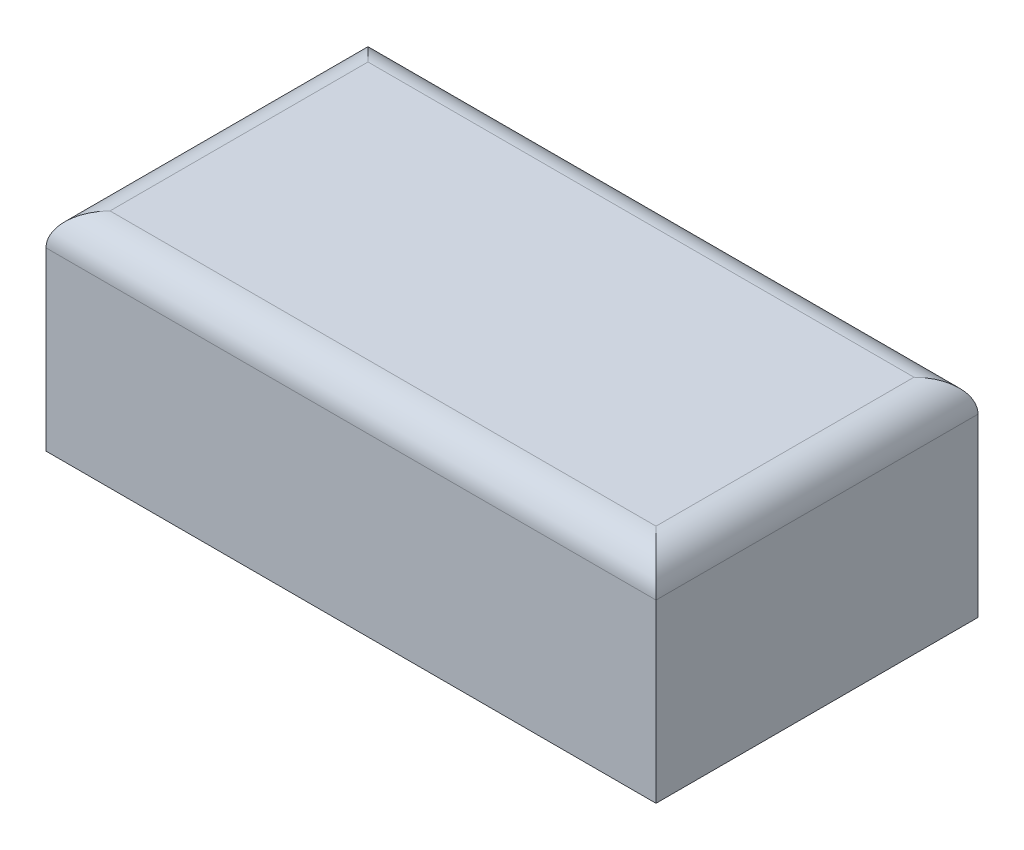
ISO-10303-21;
HEADER;
FILE_DESCRIPTION(('STEP AP214'),'2;1');
FILE_NAME('part.step','',(''),(''),'','','');
FILE_SCHEMA(('AUTOMOTIVE_DESIGN { 1 0 10303 214 1 1 1 1 }'));
ENDSEC;
DATA;
#1=APPLICATION_CONTEXT('core data for automotive mechanical design processes');
#2=APPLICATION_PROTOCOL_DEFINITION('international standard','automotive_design',2000,#1);
#3=PRODUCT_CONTEXT('',#1,'mechanical');
#4=PRODUCT('Part','Part','',(#3));
#5=PRODUCT_RELATED_PRODUCT_CATEGORY('part','',(#4));
#6=PRODUCT_DEFINITION_FORMATION('','',#4);
#7=PRODUCT_DEFINITION_CONTEXT('part definition',#1,'design');
#8=PRODUCT_DEFINITION('design','',#6,#7);
#9=PRODUCT_DEFINITION_SHAPE('','',#8);
#10=(LENGTH_UNIT() NAMED_UNIT(*) SI_UNIT(.MILLI.,.METRE.));
#11=(NAMED_UNIT(*) PLANE_ANGLE_UNIT() SI_UNIT($,.RADIAN.));
#12=(NAMED_UNIT(*) SI_UNIT($,.STERADIAN.) SOLID_ANGLE_UNIT());
#13=UNCERTAINTY_MEASURE_WITH_UNIT(LENGTH_MEASURE(1.E-05),#10,'distance_accuracy_value','');
#14=(GEOMETRIC_REPRESENTATION_CONTEXT(3) GLOBAL_UNCERTAINTY_ASSIGNED_CONTEXT((#13)) GLOBAL_UNIT_ASSIGNED_CONTEXT((#10,
#11,#12)) REPRESENTATION_CONTEXT('',''));
#15=CARTESIAN_POINT('',(0.,0.,0.));
#16=DIRECTION('',(0.,0.,1.));
#17=DIRECTION('',(1.,0.,0.));
#18=AXIS2_PLACEMENT_3D('',#15,#16,#17);
#19=CARTESIAN_POINT('',(-953.,652.,-503.));
#20=DIRECTION('',(1.,0.,0.));
#21=DIRECTION('',(0.,0.,-1.));
#22=AXIS2_PLACEMENT_3D('',#19,#20,#21);
#23=PLANE('',#22);
#24=DIRECTION('',(0.,-1.,0.));
#25=VECTOR('',#24,1.);
#26=CARTESIAN_POINT('',(-953.,652.,503.));
#27=LINE('',#26,#25);
#28=CARTESIAN_POINT('',(-953.,552.,503.));
#29=VERTEX_POINT('',#28);
#30=CARTESIAN_POINT('',(-953.,2.,503.));
#31=VERTEX_POINT('',#30);
#32=EDGE_CURVE('E226',#29,#31,#27,.T.);
#33=ORIENTED_EDGE('',*,*,#32,.F.);
#34=DIRECTION('',(0.,0.,1.));
#35=VECTOR('',#34,1.);
#36=CARTESIAN_POINT('',(-953.,552.,-503.));
#37=LINE('',#36,#35);
#38=CARTESIAN_POINT('',(-953.,552.,-503.));
#39=VERTEX_POINT('',#38);
#40=EDGE_CURVE('E256',#29,#39,#37,.F.);
#41=ORIENTED_EDGE('',*,*,#40,.T.);
#42=DIRECTION('',(0.,-1.,0.));
#43=VECTOR('',#42,1.);
#44=CARTESIAN_POINT('',(-953.,652.,-503.));
#45=LINE('',#44,#43);
#46=CARTESIAN_POINT('',(-953.,2.,-503.));
#47=VERTEX_POINT('',#46);
#48=EDGE_CURVE('E219',#39,#47,#45,.T.);
#49=ORIENTED_EDGE('',*,*,#48,.T.);
#50=DIRECTION('',(0.,0.,-1.));
#51=VECTOR('',#50,1.);
#52=CARTESIAN_POINT('',(-953.,2.,503.));
#53=LINE('',#52,#51);
#54=EDGE_CURVE('E207',#31,#47,#53,.T.);
#55=ORIENTED_EDGE('',*,*,#54,.F.);
#56=EDGE_LOOP('',(#33,#41,#49,#55));
#57=FACE_BOUND('',#56,.T.);
#58=ADVANCED_FACE('F41',(#57),#23,.F.);
#59=CARTESIAN_POINT('',(953.,652.,503.));
#60=DIRECTION('',(0.,0.,-1.));
#61=DIRECTION('',(-1.,0.,0.));
#62=AXIS2_PLACEMENT_3D('',#59,#60,#61);
#63=PLANE('',#62);
#64=DIRECTION('',(0.,-1.,0.));
#65=VECTOR('',#64,1.);
#66=CARTESIAN_POINT('',(953.,652.,503.));
#67=LINE('',#66,#65);
#68=CARTESIAN_POINT('',(953.,552.,503.));
#69=VERTEX_POINT('',#68);
#70=CARTESIAN_POINT('',(953.,2.,503.));
#71=VERTEX_POINT('',#70);
#72=EDGE_CURVE('E224',#69,#71,#67,.T.);
#73=ORIENTED_EDGE('',*,*,#72,.F.);
#74=DIRECTION('',(1.,0.,0.));
#75=VECTOR('',#74,1.);
#76=CARTESIAN_POINT('',(953.,552.,503.));
#77=LINE('',#76,#75);
#78=EDGE_CURVE('E258',#69,#29,#77,.F.);
#79=ORIENTED_EDGE('',*,*,#78,.T.);
#80=ORIENTED_EDGE('',*,*,#32,.T.);
#81=DIRECTION('',(-1.,0.,0.));
#82=VECTOR('',#81,1.);
#83=CARTESIAN_POINT('',(953.,2.,503.));
#84=LINE('',#83,#82);
#85=EDGE_CURVE('E216',#71,#31,#84,.T.);
#86=ORIENTED_EDGE('',*,*,#85,.F.);
#87=EDGE_LOOP('',(#73,#79,#80,#86));
#88=FACE_BOUND('',#87,.T.);
#89=ADVANCED_FACE('F334',(#88),#63,.F.);
#90=CARTESIAN_POINT('',(953.,652.,-503.));
#91=DIRECTION('',(-1.,0.,0.));
#92=DIRECTION('',(0.,0.,1.));
#93=AXIS2_PLACEMENT_3D('',#90,#91,#92);
#94=PLANE('',#93);
#95=DIRECTION('',(0.,-1.,0.));
#96=VECTOR('',#95,1.);
#97=CARTESIAN_POINT('',(953.,652.,-503.));
#98=LINE('',#97,#96);
#99=CARTESIAN_POINT('',(953.,552.,-503.));
#100=VERTEX_POINT('',#99);
#101=CARTESIAN_POINT('',(953.,2.,-503.));
#102=VERTEX_POINT('',#101);
#103=EDGE_CURVE('E221',#100,#102,#98,.T.);
#104=ORIENTED_EDGE('',*,*,#103,.F.);
#105=DIRECTION('',(0.,0.,-1.));
#106=VECTOR('',#105,1.);
#107=CARTESIAN_POINT('',(953.,552.,-503.));
#108=LINE('',#107,#106);
#109=EDGE_CURVE('E64',#100,#69,#108,.F.);
#110=ORIENTED_EDGE('',*,*,#109,.T.);
#111=ORIENTED_EDGE('',*,*,#72,.T.);
#112=DIRECTION('',(0.,0.,1.));
#113=VECTOR('',#112,1.);
#114=CARTESIAN_POINT('',(953.,2.,503.));
#115=LINE('',#114,#113);
#116=EDGE_CURVE('E213',#102,#71,#115,.T.);
#117=ORIENTED_EDGE('',*,*,#116,.F.);
#118=EDGE_LOOP('',(#104,#110,#111,#117));
#119=FACE_BOUND('',#118,.T.);
#120=ADVANCED_FACE('F340',(#119),#94,.F.);
#121=CARTESIAN_POINT('',(953.,652.,-503.));
#122=DIRECTION('',(0.,0.,1.));
#123=DIRECTION('',(1.,0.,0.));
#124=AXIS2_PLACEMENT_3D('',#121,#122,#123);
#125=PLANE('',#124);
#126=DIRECTION('',(1.,0.,0.));
#127=VECTOR('',#126,1.);
#128=CARTESIAN_POINT('',(953.,2.,-503.));
#129=LINE('',#128,#127);
#130=CARTESIAN_POINT('',(700.,2.,-503.));
#131=VERTEX_POINT('',#130);
#132=EDGE_CURVE('E210',#131,#102,#129,.T.);
#133=ORIENTED_EDGE('',*,*,#132,.F.);
#134=DIRECTION('',(0.,-1.,0.));
#135=VECTOR('',#134,1.);
#136=CARTESIAN_POINT('',(700.,282.,-503.));
#137=LINE('',#136,#135);
#138=CARTESIAN_POINT('',(700.,282.,-503.));
#139=VERTEX_POINT('',#138);
#140=EDGE_CURVE('E170',#139,#131,#137,.T.);
#141=ORIENTED_EDGE('',*,*,#140,.F.);
#142=DIRECTION('',(1.,0.,0.));
#143=VECTOR('',#142,1.);
#144=CARTESIAN_POINT('',(-700.,282.,-503.));
#145=LINE('',#144,#143);
#146=CARTESIAN_POINT('',(-700.,282.,-503.));
#147=VERTEX_POINT('',#146);
#148=EDGE_CURVE('E156',#147,#139,#145,.T.);
#149=ORIENTED_EDGE('',*,*,#148,.F.);
#150=DIRECTION('',(0.,1.,0.));
#151=VECTOR('',#150,1.);
#152=CARTESIAN_POINT('',(-700.,282.,-503.));
#153=LINE('',#152,#151);
#154=CARTESIAN_POINT('',(-700.,2.,-503.));
#155=VERTEX_POINT('',#154);
#156=EDGE_CURVE('E163',#155,#147,#153,.T.);
#157=ORIENTED_EDGE('',*,*,#156,.F.);
#158=EDGE_CURVE('E211',#47,#155,#129,.T.);
#159=ORIENTED_EDGE('',*,*,#158,.F.);
#160=ORIENTED_EDGE('',*,*,#48,.F.);
#161=DIRECTION('',(-1.,0.,0.));
#162=VECTOR('',#161,1.);
#163=CARTESIAN_POINT('',(953.,552.,-503.));
#164=LINE('',#163,#162);
#165=EDGE_CURVE('E253',#39,#100,#164,.F.);
#166=ORIENTED_EDGE('',*,*,#165,.T.);
#167=ORIENTED_EDGE('',*,*,#103,.T.);
#168=EDGE_LOOP('',(#133,#141,#149,#157,#159,#160,#166,#167));
#169=FACE_BOUND('',#168,.T.);
#170=ADVANCED_FACE('F173',(#169),#125,.F.);
#171=CARTESIAN_POINT('',(0.,652.,0.));
#172=DIRECTION('',(0.,-1.,0.));
#173=DIRECTION('',(0.,0.,-1.));
#174=AXIS2_PLACEMENT_3D('',#171,#172,#173);
#175=PLANE('',#174);
#176=DIRECTION('',(0.,0.,-1.));
#177=VECTOR('',#176,1.);
#178=CARTESIAN_POINT('',(853.,652.,0.));
#179=LINE('',#178,#177);
#180=CARTESIAN_POINT('',(853.,652.,403.));
#181=VERTEX_POINT('',#180);
#182=CARTESIAN_POINT('',(853.,652.,-403.));
#183=VERTEX_POINT('',#182);
#184=EDGE_CURVE('E244',#181,#183,#179,.T.);
#185=ORIENTED_EDGE('',*,*,#184,.T.);
#186=DIRECTION('',(-1.,0.,0.));
#187=VECTOR('',#186,1.);
#188=CARTESIAN_POINT('',(0.,652.,-403.));
#189=LINE('',#188,#187);
#190=CARTESIAN_POINT('',(-853.,652.,-403.));
#191=VERTEX_POINT('',#190);
#192=EDGE_CURVE('E250',#183,#191,#189,.T.);
#193=ORIENTED_EDGE('',*,*,#192,.T.);
#194=DIRECTION('',(0.,0.,1.));
#195=VECTOR('',#194,1.);
#196=CARTESIAN_POINT('',(-853.,652.,1.88274401591503E-13));
#197=LINE('',#196,#195);
#198=CARTESIAN_POINT('',(-853.,652.,403.));
#199=VERTEX_POINT('',#198);
#200=EDGE_CURVE('E248',#191,#199,#197,.T.);
#201=ORIENTED_EDGE('',*,*,#200,.T.);
#202=DIRECTION('',(1.,0.,0.));
#203=VECTOR('',#202,1.);
#204=CARTESIAN_POINT('',(0.,652.,403.));
#205=LINE('',#204,#203);
#206=EDGE_CURVE('E246',#199,#181,#205,.T.);
#207=ORIENTED_EDGE('',*,*,#206,.T.);
#208=EDGE_LOOP('',(#185,#193,#201,#207));
#209=FACE_BOUND('',#208,.T.);
#210=ADVANCED_FACE('F382',(#209),#175,.F.);
#211=CARTESIAN_POINT('',(0.,2.,0.));
#212=DIRECTION('',(0.,1.,0.));
#213=DIRECTION('',(0.,0.,1.));
#214=AXIS2_PLACEMENT_3D('',#211,#212,#213);
#215=PLANE('',#214);
#216=DIRECTION('',(1.,0.,0.));
#217=VECTOR('',#216,1.);
#218=CARTESIAN_POINT('',(950.,2.,-501.416579223504));
#219=LINE('',#218,#217);
#220=CARTESIAN_POINT('',(700.,2.,-501.416579223504));
#221=VERTEX_POINT('',#220);
#222=CARTESIAN_POINT('',(950.,2.,-501.416579223504));
#223=VERTEX_POINT('',#222);
#224=EDGE_CURVE('E185',#221,#223,#219,.T.);
#225=ORIENTED_EDGE('',*,*,#224,.F.);
#226=DIRECTION('',(0.,0.,-1.));
#227=VECTOR('',#226,1.);
#228=CARTESIAN_POINT('',(700.,2.,-1.02257383847054E-13));
#229=LINE('',#228,#227);
#230=EDGE_CURVE('E179',#221,#131,#229,.T.);
#231=ORIENTED_EDGE('',*,*,#230,.T.);
#232=ORIENTED_EDGE('',*,*,#132,.T.);
#233=ORIENTED_EDGE('',*,*,#116,.T.);
#234=ORIENTED_EDGE('',*,*,#85,.T.);
#235=ORIENTED_EDGE('',*,*,#54,.T.);
#236=ORIENTED_EDGE('',*,*,#158,.T.);
#237=DIRECTION('',(0.,0.,1.));
#238=VECTOR('',#237,1.);
#239=CARTESIAN_POINT('',(-700.,2.,1.02257383847054E-13));
#240=LINE('',#239,#238);
#241=CARTESIAN_POINT('',(-700.,2.,-501.416579223505));
#242=VERTEX_POINT('',#241);
#243=EDGE_CURVE('E166',#155,#242,#240,.T.);
#244=ORIENTED_EDGE('',*,*,#243,.T.);
#245=CARTESIAN_POINT('',(-950.,2.,-501.416579223505));
#246=VERTEX_POINT('',#245);
#247=EDGE_CURVE('E187',#246,#242,#219,.T.);
#248=ORIENTED_EDGE('',*,*,#247,.F.);
#249=DIRECTION('',(0.,0.,-1.));
#250=VECTOR('',#249,1.);
#251=CARTESIAN_POINT('',(-950.,2.,501.416579223504));
#252=LINE('',#251,#250);
#253=CARTESIAN_POINT('',(-950.,2.,501.416579223504));
#254=VERTEX_POINT('',#253);
#255=EDGE_CURVE('E183',#254,#246,#252,.T.);
#256=ORIENTED_EDGE('',*,*,#255,.F.);
#257=DIRECTION('',(-1.,0.,0.));
#258=VECTOR('',#257,1.);
#259=CARTESIAN_POINT('',(949.999999999999,2.,501.416579223504));
#260=LINE('',#259,#258);
#261=CARTESIAN_POINT('',(949.999999999999,2.,501.416579223504));
#262=VERTEX_POINT('',#261);
#263=EDGE_CURVE('E193',#262,#254,#260,.T.);
#264=ORIENTED_EDGE('',*,*,#263,.F.);
#265=DIRECTION('',(0.,0.,1.));
#266=VECTOR('',#265,1.);
#267=CARTESIAN_POINT('',(949.999999999999,2.,501.416579223504));
#268=LINE('',#267,#266);
#269=EDGE_CURVE('E190',#223,#262,#268,.T.);
#270=ORIENTED_EDGE('',*,*,#269,.F.);
#271=EDGE_LOOP('',(#225,#231,#232,#233,#234,#235,#236,#244,#248,#256,#264,#270));
#272=FACE_BOUND('',#271,.T.);
#273=ADVANCED_FACE('F286',(#272),#215,.F.);
#274=CARTESIAN_POINT('',(-950.,2.,501.416579223504));
#275=DIRECTION('',(1.,0.,0.));
#276=DIRECTION('',(0.,0.,-1.));
#277=AXIS2_PLACEMENT_3D('',#274,#275,#276);
#278=PLANE('',#277);
#279=DIRECTION('',(0.,1.,0.));
#280=VECTOR('',#279,1.);
#281=CARTESIAN_POINT('',(-950.,2.,-501.416579223505));
#282=LINE('',#281,#280);
#283=CARTESIAN_POINT('',(-950.,550.,-501.416579223505));
#284=VERTEX_POINT('',#283);
#285=EDGE_CURVE('E204',#246,#284,#282,.T.);
#286=ORIENTED_EDGE('',*,*,#285,.T.);
#287=DIRECTION('',(0.,0.,-1.));
#288=VECTOR('',#287,1.);
#289=CARTESIAN_POINT('',(-950.,550.,501.416579223504));
#290=LINE('',#289,#288);
#291=CARTESIAN_POINT('',(-950.,550.,501.416579223504));
#292=VERTEX_POINT('',#291);
#293=EDGE_CURVE('E242',#284,#292,#290,.F.);
#294=ORIENTED_EDGE('',*,*,#293,.T.);
#295=DIRECTION('',(0.,1.,0.));
#296=VECTOR('',#295,1.);
#297=CARTESIAN_POINT('',(-950.,2.,501.416579223504));
#298=LINE('',#297,#296);
#299=EDGE_CURVE('E195',#254,#292,#298,.T.);
#300=ORIENTED_EDGE('',*,*,#299,.F.);
#301=ORIENTED_EDGE('',*,*,#255,.T.);
#302=EDGE_LOOP('',(#286,#294,#300,#301));
#303=FACE_BOUND('',#302,.T.);
#304=ADVANCED_FACE('F294',(#303),#278,.T.);
#305=CARTESIAN_POINT('',(950.,2.,-501.416579223504));
#306=DIRECTION('',(0.,0.,1.));
#307=DIRECTION('',(1.,0.,0.));
#308=AXIS2_PLACEMENT_3D('',#305,#306,#307);
#309=PLANE('',#308);
#310=DIRECTION('',(0.,1.,0.));
#311=VECTOR('',#310,1.);
#312=CARTESIAN_POINT('',(700.,2.00000000000005,-501.416579223504));
#313=LINE('',#312,#311);
#314=CARTESIAN_POINT('',(700.,282.,-501.416579223505));
#315=VERTEX_POINT('',#314);
#316=EDGE_CURVE('E11',#221,#315,#313,.T.);
#317=ORIENTED_EDGE('',*,*,#316,.F.);
#318=ORIENTED_EDGE('',*,*,#224,.T.);
#319=DIRECTION('',(0.,1.,0.));
#320=VECTOR('',#319,1.);
#321=CARTESIAN_POINT('',(950.,2.,-501.416579223504));
#322=LINE('',#321,#320);
#323=CARTESIAN_POINT('',(950.,550.,-501.416579223504));
#324=VERTEX_POINT('',#323);
#325=EDGE_CURVE('E201',#223,#324,#322,.T.);
#326=ORIENTED_EDGE('',*,*,#325,.T.);
#327=DIRECTION('',(1.,0.,0.));
#328=VECTOR('',#327,1.);
#329=CARTESIAN_POINT('',(-950.,550.,-501.416579223505));
#330=LINE('',#329,#328);
#331=EDGE_CURVE('E240',#324,#284,#330,.F.);
#332=ORIENTED_EDGE('',*,*,#331,.T.);
#333=ORIENTED_EDGE('',*,*,#285,.F.);
#334=ORIENTED_EDGE('',*,*,#247,.T.);
#335=DIRECTION('',(0.,-1.,0.));
#336=VECTOR('',#335,1.);
#337=CARTESIAN_POINT('',(-700.,2.00000000000033,-501.416579223505));
#338=LINE('',#337,#336);
#339=CARTESIAN_POINT('',(-700.,282.,-501.416579223505));
#340=VERTEX_POINT('',#339);
#341=EDGE_CURVE('E263',#340,#242,#338,.T.);
#342=ORIENTED_EDGE('',*,*,#341,.F.);
#343=DIRECTION('',(-1.,0.,0.));
#344=VECTOR('',#343,1.);
#345=CARTESIAN_POINT('',(950.,282.,-501.416579223504));
#346=LINE('',#345,#344);
#347=EDGE_CURVE('E49',#315,#340,#346,.T.);
#348=ORIENTED_EDGE('',*,*,#347,.F.);
#349=EDGE_LOOP('',(#317,#318,#326,#332,#333,#334,#342,#348));
#350=FACE_BOUND('',#349,.T.);
#351=ADVANCED_FACE('F290',(#350),#309,.T.);
#352=CARTESIAN_POINT('',(949.999999999999,2.,501.416579223504));
#353=DIRECTION('',(-1.,0.,0.));
#354=DIRECTION('',(0.,0.,1.));
#355=AXIS2_PLACEMENT_3D('',#352,#353,#354);
#356=PLANE('',#355);
#357=DIRECTION('',(0.,1.,0.));
#358=VECTOR('',#357,1.);
#359=CARTESIAN_POINT('',(949.999999999999,2.,501.416579223504));
#360=LINE('',#359,#358);
#361=CARTESIAN_POINT('',(949.999999999999,550.,501.416579223504));
#362=VERTEX_POINT('',#361);
#363=EDGE_CURVE('E198',#262,#362,#360,.T.);
#364=ORIENTED_EDGE('',*,*,#363,.T.);
#365=DIRECTION('',(0.,0.,1.));
#366=VECTOR('',#365,1.);
#367=CARTESIAN_POINT('',(950.,550.,-501.416579223504));
#368=LINE('',#367,#366);
#369=EDGE_CURVE('E260',#362,#324,#368,.F.);
#370=ORIENTED_EDGE('',*,*,#369,.T.);
#371=ORIENTED_EDGE('',*,*,#325,.F.);
#372=ORIENTED_EDGE('',*,*,#269,.T.);
#373=EDGE_LOOP('',(#364,#370,#371,#372));
#374=FACE_BOUND('',#373,.T.);
#375=ADVANCED_FACE('F314',(#374),#356,.T.);
#376=CARTESIAN_POINT('',(949.999999999999,2.,501.416579223504));
#377=DIRECTION('',(0.,0.,-1.));
#378=DIRECTION('',(-1.,0.,0.));
#379=AXIS2_PLACEMENT_3D('',#376,#377,#378);
#380=PLANE('',#379);
#381=ORIENTED_EDGE('',*,*,#299,.T.);
#382=DIRECTION('',(-1.,0.,0.));
#383=VECTOR('',#382,1.);
#384=CARTESIAN_POINT('',(949.999999999999,550.,501.416579223504));
#385=LINE('',#384,#383);
#386=EDGE_CURVE('E237',#292,#362,#385,.F.);
#387=ORIENTED_EDGE('',*,*,#386,.T.);
#388=ORIENTED_EDGE('',*,*,#363,.F.);
#389=ORIENTED_EDGE('',*,*,#263,.T.);
#390=EDGE_LOOP('',(#381,#387,#388,#389));
#391=FACE_BOUND('',#390,.T.);
#392=ADVANCED_FACE('F312',(#391),#380,.T.);
#393=CARTESIAN_POINT('',(0.,650.,0.));
#394=DIRECTION('',(0.,-1.,0.));
#395=DIRECTION('',(0.,0.,-1.));
#396=AXIS2_PLACEMENT_3D('',#393,#394,#395);
#397=PLANE('',#396);
#398=DIRECTION('',(-1.,0.,0.));
#399=VECTOR('',#398,1.);
#400=CARTESIAN_POINT('',(-950.,650.,401.416579223504));
#401=LINE('',#400,#399);
#402=CARTESIAN_POINT('',(849.999999999999,650.,401.416579223504));
#403=VERTEX_POINT('',#402);
#404=CARTESIAN_POINT('',(-850.000000000001,650.,401.416579223504));
#405=VERTEX_POINT('',#404);
#406=EDGE_CURVE('E232',#403,#405,#401,.T.);
#407=ORIENTED_EDGE('',*,*,#406,.T.);
#408=DIRECTION('',(0.,0.,-1.));
#409=VECTOR('',#408,1.);
#410=CARTESIAN_POINT('',(-850.,650.,-501.416579223505));
#411=LINE('',#410,#409);
#412=CARTESIAN_POINT('',(-850.,650.,-401.416579223505));
#413=VERTEX_POINT('',#412);
#414=EDGE_CURVE('E235',#405,#413,#411,.T.);
#415=ORIENTED_EDGE('',*,*,#414,.T.);
#416=DIRECTION('',(1.,0.,0.));
#417=VECTOR('',#416,1.);
#418=CARTESIAN_POINT('',(950.,650.,-401.416579223504));
#419=LINE('',#418,#417);
#420=CARTESIAN_POINT('',(850.,650.,-401.416579223504));
#421=VERTEX_POINT('',#420);
#422=EDGE_CURVE('E230',#413,#421,#419,.T.);
#423=ORIENTED_EDGE('',*,*,#422,.T.);
#424=DIRECTION('',(0.,0.,1.));
#425=VECTOR('',#424,1.);
#426=CARTESIAN_POINT('',(849.999999999999,650.,501.416579223504));
#427=LINE('',#426,#425);
#428=EDGE_CURVE('E228',#421,#403,#427,.T.);
#429=ORIENTED_EDGE('',*,*,#428,.T.);
#430=EDGE_LOOP('',(#407,#415,#423,#429));
#431=FACE_BOUND('',#430,.T.);
#432=ADVANCED_FACE('F355',(#431),#397,.T.);
#433=CARTESIAN_POINT('',(0.,550.,-401.416579223505));
#434=DIRECTION('',(-1.,0.,0.));
#435=DIRECTION('',(0.,0.,1.));
#436=AXIS2_PLACEMENT_3D('',#433,#434,#435);
#437=CYLINDRICAL_SURFACE('',#436,100.);
#438=CARTESIAN_POINT('',(-850.000000000001,550.,-401.416579223505));
#439=DIRECTION('',(-0.707106781186548,0.,0.707106781186547));
#440=DIRECTION('',(-0.707106781186547,0.,-0.707106781186548));
#441=AXIS2_PLACEMENT_3D('',#438,#439,#440);
#442=ELLIPSE('',#441,141.421356237309,100.);
#443=EDGE_CURVE('E269',#284,#413,#442,.F.);
#444=ORIENTED_EDGE('',*,*,#443,.F.);
#445=ORIENTED_EDGE('',*,*,#331,.F.);
#446=CARTESIAN_POINT('',(849.999999999999,550.,-401.416579223504));
#447=DIRECTION('',(-0.707106781186547,0.,-0.707106781186548));
#448=DIRECTION('',(-0.707106781186548,0.,0.707106781186547));
#449=AXIS2_PLACEMENT_3D('',#446,#447,#448);
#450=ELLIPSE('',#449,141.421356237309,100.);
#451=EDGE_CURVE('E186',#421,#324,#450,.T.);
#452=ORIENTED_EDGE('',*,*,#451,.F.);
#453=ORIENTED_EDGE('',*,*,#422,.F.);
#454=EDGE_LOOP('',(#444,#445,#452,#453));
#455=FACE_BOUND('',#454,.T.);
#456=ADVANCED_FACE('F299',(#455),#437,.F.);
#457=CARTESIAN_POINT('',(849.999999999999,550.,0.));
#458=DIRECTION('',(0.,0.,-1.));
#459=DIRECTION('',(-1.,0.,0.));
#460=AXIS2_PLACEMENT_3D('',#457,#458,#459);
#461=CYLINDRICAL_SURFACE('',#460,100.);
#462=ORIENTED_EDGE('',*,*,#451,.T.);
#463=ORIENTED_EDGE('',*,*,#369,.F.);
#464=CARTESIAN_POINT('',(849.999999999999,550.,401.416579223504));
#465=DIRECTION('',(0.707106781186548,0.,-0.707106781186547));
#466=DIRECTION('',(0.707106781186547,0.,0.707106781186548));
#467=AXIS2_PLACEMENT_3D('',#464,#465,#466);
#468=ELLIPSE('',#467,141.421356237309,100.);
#469=EDGE_CURVE('E266',#403,#362,#468,.T.);
#470=ORIENTED_EDGE('',*,*,#469,.F.);
#471=ORIENTED_EDGE('',*,*,#428,.F.);
#472=EDGE_LOOP('',(#462,#463,#470,#471));
#473=FACE_BOUND('',#472,.T.);
#474=ADVANCED_FACE('F350',(#473),#461,.F.);
#475=CARTESIAN_POINT('',(-850.000000000001,550.,0.));
#476=DIRECTION('',(0.,0.,1.));
#477=DIRECTION('',(1.,0.,0.));
#478=AXIS2_PLACEMENT_3D('',#475,#476,#477);
#479=CYLINDRICAL_SURFACE('',#478,100.);
#480=ORIENTED_EDGE('',*,*,#443,.T.);
#481=ORIENTED_EDGE('',*,*,#414,.F.);
#482=CARTESIAN_POINT('',(-850.000000000001,550.,401.416579223504));
#483=DIRECTION('',(0.707106781186547,0.,0.707106781186548));
#484=DIRECTION('',(0.707106781186548,0.,-0.707106781186547));
#485=AXIS2_PLACEMENT_3D('',#482,#483,#484);
#486=ELLIPSE('',#485,141.421356237309,100.);
#487=EDGE_CURVE('E264',#292,#405,#486,.F.);
#488=ORIENTED_EDGE('',*,*,#487,.F.);
#489=ORIENTED_EDGE('',*,*,#293,.F.);
#490=EDGE_LOOP('',(#480,#481,#488,#489));
#491=FACE_BOUND('',#490,.T.);
#492=ADVANCED_FACE('F304',(#491),#479,.F.);
#493=CARTESIAN_POINT('',(0.,550.,401.416579223504));
#494=DIRECTION('',(1.,0.,0.));
#495=DIRECTION('',(0.,0.,-1.));
#496=AXIS2_PLACEMENT_3D('',#493,#494,#495);
#497=CYLINDRICAL_SURFACE('',#496,100.);
#498=ORIENTED_EDGE('',*,*,#469,.T.);
#499=ORIENTED_EDGE('',*,*,#386,.F.);
#500=ORIENTED_EDGE('',*,*,#487,.T.);
#501=ORIENTED_EDGE('',*,*,#406,.F.);
#502=EDGE_LOOP('',(#498,#499,#500,#501));
#503=FACE_BOUND('',#502,.T.);
#504=ADVANCED_FACE('F308',(#503),#497,.F.);
#505=CARTESIAN_POINT('',(0.,552.,403.));
#506=DIRECTION('',(1.,0.,0.));
#507=DIRECTION('',(0.,0.,-1.));
#508=AXIS2_PLACEMENT_3D('',#505,#506,#507);
#509=CYLINDRICAL_SURFACE('',#508,100.);
#510=CARTESIAN_POINT('',(-853.,552.,403.));
#511=DIRECTION('',(0.707106781186548,0.,0.707106781186547));
#512=DIRECTION('',(0.707106781186547,0.,-0.707106781186548));
#513=AXIS2_PLACEMENT_3D('',#510,#511,#512);
#514=ELLIPSE('',#513,141.421356237309,100.);
#515=EDGE_CURVE('E277',#29,#199,#514,.F.);
#516=ORIENTED_EDGE('',*,*,#515,.F.);
#517=ORIENTED_EDGE('',*,*,#78,.F.);
#518=CARTESIAN_POINT('',(853.,552.,403.));
#519=DIRECTION('',(0.707106781186547,0.,-0.707106781186548));
#520=DIRECTION('',(-0.707106781186548,0.,-0.707106781186547));
#521=AXIS2_PLACEMENT_3D('',#518,#519,#520);
#522=ELLIPSE('',#521,141.421356237309,100.);
#523=EDGE_CURVE('E267',#181,#69,#522,.T.);
#524=ORIENTED_EDGE('',*,*,#523,.F.);
#525=ORIENTED_EDGE('',*,*,#206,.F.);
#526=EDGE_LOOP('',(#516,#517,#524,#525));
#527=FACE_BOUND('',#526,.T.);
#528=ADVANCED_FACE('F43',(#527),#509,.T.);
#529=CARTESIAN_POINT('',(853.,552.,0.));
#530=DIRECTION('',(0.,0.,-1.));
#531=DIRECTION('',(-1.,0.,0.));
#532=AXIS2_PLACEMENT_3D('',#529,#530,#531);
#533=CYLINDRICAL_SURFACE('',#532,100.);
#534=ORIENTED_EDGE('',*,*,#523,.T.);
#535=ORIENTED_EDGE('',*,*,#109,.F.);
#536=CARTESIAN_POINT('',(853.,552.,-403.));
#537=DIRECTION('',(-0.707106781186548,0.,-0.707106781186547));
#538=DIRECTION('',(0.707106781186547,0.,-0.707106781186548));
#539=AXIS2_PLACEMENT_3D('',#536,#537,#538);
#540=ELLIPSE('',#539,141.421356237309,100.);
#541=EDGE_CURVE('E275',#183,#100,#540,.T.);
#542=ORIENTED_EDGE('',*,*,#541,.F.);
#543=ORIENTED_EDGE('',*,*,#184,.F.);
#544=EDGE_LOOP('',(#534,#535,#542,#543));
#545=FACE_BOUND('',#544,.T.);
#546=ADVANCED_FACE('F358',(#545),#533,.T.);
#547=CARTESIAN_POINT('',(-853.,552.,1.88274401591503E-13));
#548=DIRECTION('',(0.,0.,1.));
#549=DIRECTION('',(1.,0.,0.));
#550=AXIS2_PLACEMENT_3D('',#547,#548,#549);
#551=CYLINDRICAL_SURFACE('',#550,100.);
#552=ORIENTED_EDGE('',*,*,#515,.T.);
#553=ORIENTED_EDGE('',*,*,#200,.F.);
#554=CARTESIAN_POINT('',(-853.,552.,-403.));
#555=DIRECTION('',(-0.707106781186547,0.,0.707106781186548));
#556=DIRECTION('',(0.707106781186548,0.,0.707106781186547));
#557=AXIS2_PLACEMENT_3D('',#554,#555,#556);
#558=ELLIPSE('',#557,141.42135623731,100.);
#559=EDGE_CURVE('E182',#39,#191,#558,.F.);
#560=ORIENTED_EDGE('',*,*,#559,.F.);
#561=ORIENTED_EDGE('',*,*,#40,.F.);
#562=EDGE_LOOP('',(#552,#553,#560,#561));
#563=FACE_BOUND('',#562,.T.);
#564=ADVANCED_FACE('F329',(#563),#551,.T.);
#565=CARTESIAN_POINT('',(0.,552.,-403.));
#566=DIRECTION('',(-1.,0.,0.));
#567=DIRECTION('',(0.,0.,1.));
#568=AXIS2_PLACEMENT_3D('',#565,#566,#567);
#569=CYLINDRICAL_SURFACE('',#568,100.);
#570=ORIENTED_EDGE('',*,*,#541,.T.);
#571=ORIENTED_EDGE('',*,*,#165,.F.);
#572=ORIENTED_EDGE('',*,*,#559,.T.);
#573=ORIENTED_EDGE('',*,*,#192,.F.);
#574=EDGE_LOOP('',(#570,#571,#572,#573));
#575=FACE_BOUND('',#574,.T.);
#576=ADVANCED_FACE('F321',(#575),#569,.T.);
#577=CARTESIAN_POINT('',(700.,282.,-360.000000000001));
#578=DIRECTION('',(1.,0.,0.));
#579=DIRECTION('',(0.,1.,0.));
#580=AXIS2_PLACEMENT_3D('',#577,#578,#579);
#581=PLANE('',#580);
#582=ORIENTED_EDGE('',*,*,#316,.T.);
#583=DIRECTION('',(0.,0.,-1.));
#584=VECTOR('',#583,1.);
#585=CARTESIAN_POINT('',(700.,282.,-360.000000000001));
#586=LINE('',#585,#584);
#587=EDGE_CURVE('E160',#315,#139,#586,.T.);
#588=ORIENTED_EDGE('',*,*,#587,.T.);
#589=ORIENTED_EDGE('',*,*,#140,.T.);
#590=ORIENTED_EDGE('',*,*,#230,.F.);
#591=EDGE_LOOP('',(#582,#588,#589,#590));
#592=FACE_BOUND('',#591,.T.);
#593=ADVANCED_FACE('F319',(#592),#581,.F.);
#594=CARTESIAN_POINT('',(-700.,282.,-360.));
#595=DIRECTION('',(-1.,0.,0.));
#596=DIRECTION('',(0.,-1.,0.));
#597=AXIS2_PLACEMENT_3D('',#594,#595,#596);
#598=PLANE('',#597);
#599=ORIENTED_EDGE('',*,*,#156,.T.);
#600=DIRECTION('',(0.,0.,-1.));
#601=VECTOR('',#600,1.);
#602=CARTESIAN_POINT('',(-700.,282.,-360.));
#603=LINE('',#602,#601);
#604=EDGE_CURVE('E56',#340,#147,#603,.T.);
#605=ORIENTED_EDGE('',*,*,#604,.F.);
#606=ORIENTED_EDGE('',*,*,#341,.T.);
#607=ORIENTED_EDGE('',*,*,#243,.F.);
#608=EDGE_LOOP('',(#599,#605,#606,#607));
#609=FACE_BOUND('',#608,.T.);
#610=ADVANCED_FACE('F164',(#609),#598,.F.);
#611=CARTESIAN_POINT('',(-700.,282.,-360.));
#612=DIRECTION('',(0.,1.,0.));
#613=DIRECTION('',(-1.,0.,0.));
#614=AXIS2_PLACEMENT_3D('',#611,#612,#613);
#615=PLANE('',#614);
#616=ORIENTED_EDGE('',*,*,#347,.T.);
#617=ORIENTED_EDGE('',*,*,#604,.T.);
#618=ORIENTED_EDGE('',*,*,#148,.T.);
#619=ORIENTED_EDGE('',*,*,#587,.F.);
#620=EDGE_LOOP('',(#616,#617,#618,#619));
#621=FACE_BOUND('',#620,.T.);
#622=ADVANCED_FACE('F153',(#621),#615,.F.);
#623=CLOSED_SHELL('',(#58,#89,#120,#170,#210,#273,#304,#351,#375,#392,#432,#456,#474,#492,#504,
#528,#546,#564,#576,#593,#610,#622));
#624=MANIFOLD_SOLID_BREP('B2',#623);
#625=ADVANCED_BREP_SHAPE_REPRESENTATION('',(#18,#624),#14);
#626=SHAPE_DEFINITION_REPRESENTATION(#9,#625);
ENDSEC;
END-ISO-10303-21;
